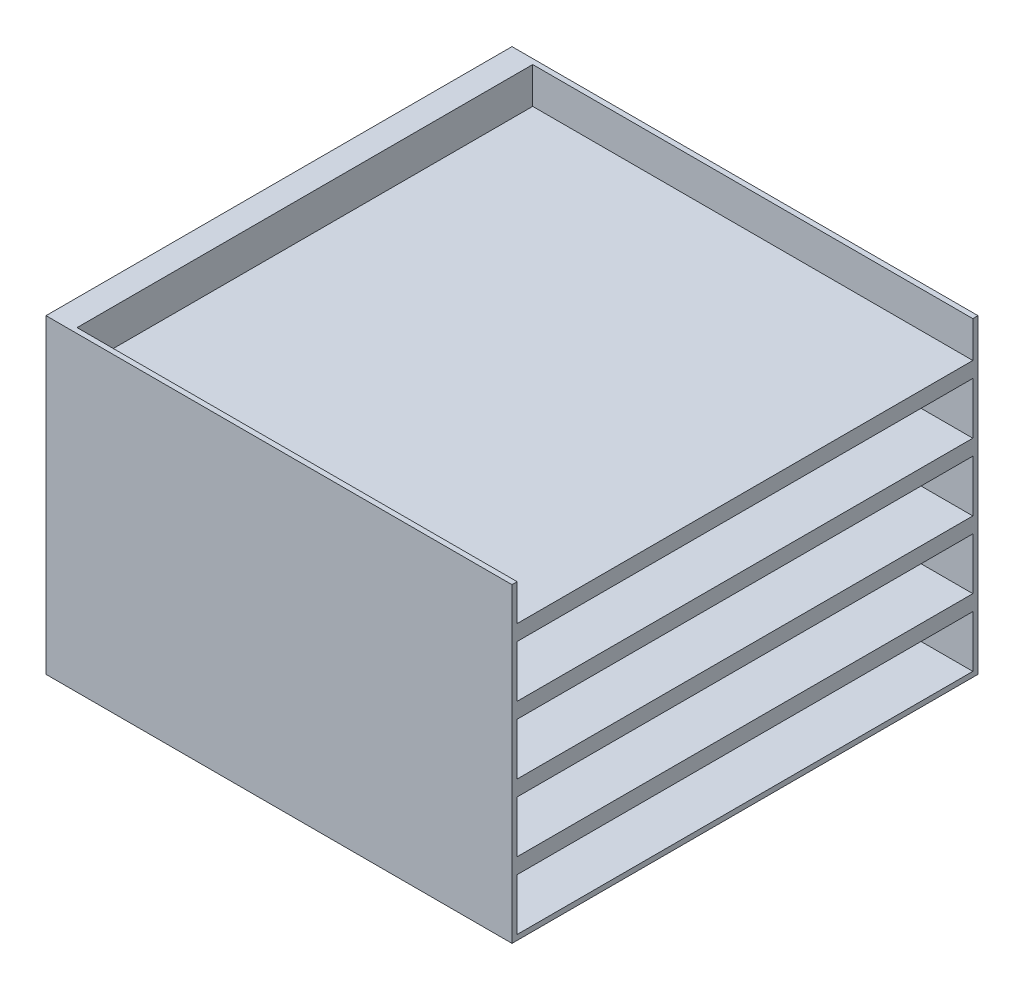
ISO-10303-21;
HEADER;
FILE_DESCRIPTION(('STEP AP214'),'2;1');
FILE_NAME('part.step','',(''),(''),'','','');
FILE_SCHEMA(('AUTOMOTIVE_DESIGN { 1 0 10303 214 1 1 1 1 }'));
ENDSEC;
DATA;
#1=APPLICATION_CONTEXT('core data for automotive mechanical design processes');
#2=APPLICATION_PROTOCOL_DEFINITION('international standard','automotive_design',2000,#1);
#3=PRODUCT_CONTEXT('',#1,'mechanical');
#4=PRODUCT('Part','Part','',(#3));
#5=PRODUCT_RELATED_PRODUCT_CATEGORY('part','',(#4));
#6=PRODUCT_DEFINITION_FORMATION('','',#4);
#7=PRODUCT_DEFINITION_CONTEXT('part definition',#1,'design');
#8=PRODUCT_DEFINITION('design','',#6,#7);
#9=PRODUCT_DEFINITION_SHAPE('','',#8);
#10=(LENGTH_UNIT() NAMED_UNIT(*) SI_UNIT(.MILLI.,.METRE.));
#11=(NAMED_UNIT(*) PLANE_ANGLE_UNIT() SI_UNIT($,.RADIAN.));
#12=(NAMED_UNIT(*) SI_UNIT($,.STERADIAN.) SOLID_ANGLE_UNIT());
#13=UNCERTAINTY_MEASURE_WITH_UNIT(LENGTH_MEASURE(1.E-05),#10,'distance_accuracy_value','');
#14=(GEOMETRIC_REPRESENTATION_CONTEXT(3) GLOBAL_UNCERTAINTY_ASSIGNED_CONTEXT((#13)) GLOBAL_UNIT_ASSIGNED_CONTEXT((#10,
#11,#12)) REPRESENTATION_CONTEXT('',''));
#15=CARTESIAN_POINT('',(0.,0.,0.));
#16=DIRECTION('',(0.,0.,1.));
#17=DIRECTION('',(1.,0.,0.));
#18=AXIS2_PLACEMENT_3D('',#15,#16,#17);
#19=CARTESIAN_POINT('',(450.,600.,-450.));
#20=DIRECTION('',(-1.,0.,0.));
#21=DIRECTION('',(0.,0.,1.));
#22=AXIS2_PLACEMENT_3D('',#19,#20,#21);
#23=PLANE('',#22);
#24=DIRECTION('',(0.,0.,-1.));
#25=VECTOR('',#24,1.);
#26=CARTESIAN_POINT('',(450.,140.,-440.));
#27=LINE('',#26,#25);
#28=CARTESIAN_POINT('',(450.,140.,440.));
#29=VERTEX_POINT('',#28);
#30=CARTESIAN_POINT('',(450.,140.,-440.));
#31=VERTEX_POINT('',#30);
#32=EDGE_CURVE('E222',#29,#31,#27,.T.);
#33=ORIENTED_EDGE('',*,*,#32,.F.);
#34=DIRECTION('',(0.,-1.,0.));
#35=VECTOR('',#34,1.);
#36=CARTESIAN_POINT('',(450.,240.,440.));
#37=LINE('',#36,#35);
#38=CARTESIAN_POINT('',(450.,240.,440.));
#39=VERTEX_POINT('',#38);
#40=EDGE_CURVE('E48',#39,#29,#37,.T.);
#41=ORIENTED_EDGE('',*,*,#40,.F.);
#42=DIRECTION('',(0.,0.,1.));
#43=VECTOR('',#42,1.);
#44=CARTESIAN_POINT('',(450.,240.,-440.));
#45=LINE('',#44,#43);
#46=CARTESIAN_POINT('',(450.,240.,-440.));
#47=VERTEX_POINT('',#46);
#48=EDGE_CURVE('E213',#47,#39,#45,.T.);
#49=ORIENTED_EDGE('',*,*,#48,.F.);
#50=DIRECTION('',(0.,1.,0.));
#51=VECTOR('',#50,1.);
#52=CARTESIAN_POINT('',(450.,240.,-440.));
#53=LINE('',#52,#51);
#54=EDGE_CURVE('E216',#31,#47,#53,.T.);
#55=ORIENTED_EDGE('',*,*,#54,.F.);
#56=EDGE_LOOP('',(#33,#41,#49,#55));
#57=FACE_BOUND('',#56,.T.);
#58=DIRECTION('',(0.,0.,-1.));
#59=VECTOR('',#58,1.);
#60=CARTESIAN_POINT('',(450.,270.,-439.999999999999));
#61=LINE('',#60,#59);
#62=CARTESIAN_POINT('',(450.,270.,440.000000000001));
#63=VERTEX_POINT('',#62);
#64=CARTESIAN_POINT('',(450.,270.,-439.999999999999));
#65=VERTEX_POINT('',#64);
#66=EDGE_CURVE('E248',#63,#65,#61,.T.);
#67=ORIENTED_EDGE('',*,*,#66,.F.);
#68=DIRECTION('',(0.,-1.,0.));
#69=VECTOR('',#68,1.);
#70=CARTESIAN_POINT('',(450.,370.,440.000000000001));
#71=LINE('',#70,#69);
#72=CARTESIAN_POINT('',(450.,370.,440.000000000001));
#73=VERTEX_POINT('',#72);
#74=EDGE_CURVE('E56',#73,#63,#71,.T.);
#75=ORIENTED_EDGE('',*,*,#74,.F.);
#76=DIRECTION('',(0.,0.,1.));
#77=VECTOR('',#76,1.);
#78=CARTESIAN_POINT('',(450.,370.,-439.999999999999));
#79=LINE('',#78,#77);
#80=CARTESIAN_POINT('',(450.,370.,-439.999999999999));
#81=VERTEX_POINT('',#80);
#82=EDGE_CURVE('E237',#81,#73,#79,.T.);
#83=ORIENTED_EDGE('',*,*,#82,.F.);
#84=DIRECTION('',(0.,1.,0.));
#85=VECTOR('',#84,1.);
#86=CARTESIAN_POINT('',(450.,370.,-439.999999999999));
#87=LINE('',#86,#85);
#88=EDGE_CURVE('E252',#65,#81,#87,.T.);
#89=ORIENTED_EDGE('',*,*,#88,.F.);
#90=EDGE_LOOP('',(#67,#75,#83,#89));
#91=FACE_BOUND('',#90,.T.);
#92=DIRECTION('',(0.,0.,-1.));
#93=VECTOR('',#92,1.);
#94=CARTESIAN_POINT('',(450.,400.,-439.999999999999));
#95=LINE('',#94,#93);
#96=CARTESIAN_POINT('',(450.,400.,440.000000000001));
#97=VERTEX_POINT('',#96);
#98=CARTESIAN_POINT('',(450.,400.,-439.999999999999));
#99=VERTEX_POINT('',#98);
#100=EDGE_CURVE('E279',#97,#99,#95,.T.);
#101=ORIENTED_EDGE('',*,*,#100,.F.);
#102=DIRECTION('',(0.,-1.,0.));
#103=VECTOR('',#102,1.);
#104=CARTESIAN_POINT('',(450.,500.,440.000000000001));
#105=LINE('',#104,#103);
#106=CARTESIAN_POINT('',(450.,500.,440.000000000001));
#107=VERTEX_POINT('',#106);
#108=EDGE_CURVE('E277',#107,#97,#105,.T.);
#109=ORIENTED_EDGE('',*,*,#108,.F.);
#110=DIRECTION('',(0.,0.,1.));
#111=VECTOR('',#110,1.);
#112=CARTESIAN_POINT('',(450.,500.,-439.999999999999));
#113=LINE('',#112,#111);
#114=CARTESIAN_POINT('',(450.,500.,-439.999999999999));
#115=VERTEX_POINT('',#114);
#116=EDGE_CURVE('E267',#115,#107,#113,.T.);
#117=ORIENTED_EDGE('',*,*,#116,.F.);
#118=DIRECTION('',(0.,1.,0.));
#119=VECTOR('',#118,1.);
#120=CARTESIAN_POINT('',(450.,500.,-439.999999999999));
#121=LINE('',#120,#119);
#122=EDGE_CURVE('E283',#99,#115,#121,.T.);
#123=ORIENTED_EDGE('',*,*,#122,.F.);
#124=EDGE_LOOP('',(#101,#109,#117,#123));
#125=FACE_BOUND('',#124,.T.);
#126=DIRECTION('',(0.,0.,-1.));
#127=VECTOR('',#126,1.);
#128=CARTESIAN_POINT('',(450.,10.,-440.));
#129=LINE('',#128,#127);
#130=CARTESIAN_POINT('',(450.,10.,440.));
#131=VERTEX_POINT('',#130);
#132=CARTESIAN_POINT('',(450.,10.,-440.));
#133=VERTEX_POINT('',#132);
#134=EDGE_CURVE('E328',#131,#133,#129,.T.);
#135=ORIENTED_EDGE('',*,*,#134,.F.);
#136=DIRECTION('',(0.,-1.,0.));
#137=VECTOR('',#136,1.);
#138=CARTESIAN_POINT('',(450.,110.,440.));
#139=LINE('',#138,#137);
#140=CARTESIAN_POINT('',(450.,110.,440.));
#141=VERTEX_POINT('',#140);
#142=EDGE_CURVE('E229',#141,#131,#139,.T.);
#143=ORIENTED_EDGE('',*,*,#142,.F.);
#144=DIRECTION('',(0.,0.,1.));
#145=VECTOR('',#144,1.);
#146=CARTESIAN_POINT('',(450.,110.,-440.));
#147=LINE('',#146,#145);
#148=CARTESIAN_POINT('',(450.,110.,-440.));
#149=VERTEX_POINT('',#148);
#150=EDGE_CURVE('E317',#149,#141,#147,.T.);
#151=ORIENTED_EDGE('',*,*,#150,.F.);
#152=DIRECTION('',(0.,1.,0.));
#153=VECTOR('',#152,1.);
#154=CARTESIAN_POINT('',(450.,110.,-440.));
#155=LINE('',#154,#153);
#156=EDGE_CURVE('E331',#133,#149,#155,.T.);
#157=ORIENTED_EDGE('',*,*,#156,.F.);
#158=EDGE_LOOP('',(#135,#143,#151,#157));
#159=FACE_BOUND('',#158,.T.);
#160=DIRECTION('',(0.,0.,-1.));
#161=VECTOR('',#160,1.);
#162=CARTESIAN_POINT('',(450.,530.,-439.999999999998));
#163=LINE('',#162,#161);
#164=CARTESIAN_POINT('',(450.,530.,440.000000000002));
#165=VERTEX_POINT('',#164);
#166=CARTESIAN_POINT('',(450.,530.,-439.999999999998));
#167=VERTEX_POINT('',#166);
#168=EDGE_CURVE('E306',#165,#167,#163,.T.);
#169=ORIENTED_EDGE('',*,*,#168,.F.);
#170=DIRECTION('',(0.,-1.,0.));
#171=VECTOR('',#170,1.);
#172=CARTESIAN_POINT('',(450.,630.,440.000000000002));
#173=LINE('',#172,#171);
#174=CARTESIAN_POINT('',(450.,600.,440.000000000002));
#175=VERTEX_POINT('',#174);
#176=EDGE_CURVE('E304',#175,#165,#173,.T.);
#177=ORIENTED_EDGE('',*,*,#176,.F.);
#178=DIRECTION('',(0.,0.,-1.));
#179=VECTOR('',#178,1.);
#180=CARTESIAN_POINT('',(450.,600.,-450.));
#181=LINE('',#180,#179);
#182=CARTESIAN_POINT('',(450.,600.,450.));
#183=VERTEX_POINT('',#182);
#184=EDGE_CURVE('E345',#183,#175,#181,.T.);
#185=ORIENTED_EDGE('',*,*,#184,.F.);
#186=DIRECTION('',(0.,-1.,0.));
#187=VECTOR('',#186,1.);
#188=CARTESIAN_POINT('',(450.,600.,450.));
#189=LINE('',#188,#187);
#190=CARTESIAN_POINT('',(450.,0.,450.));
#191=VERTEX_POINT('',#190);
#192=EDGE_CURVE('E355',#183,#191,#189,.T.);
#193=ORIENTED_EDGE('',*,*,#192,.T.);
#194=DIRECTION('',(0.,0.,-1.));
#195=VECTOR('',#194,1.);
#196=CARTESIAN_POINT('',(450.,0.,-450.));
#197=LINE('',#196,#195);
#198=CARTESIAN_POINT('',(450.,0.,-450.));
#199=VERTEX_POINT('',#198);
#200=EDGE_CURVE('E338',#191,#199,#197,.T.);
#201=ORIENTED_EDGE('',*,*,#200,.T.);
#202=DIRECTION('',(0.,-1.,0.));
#203=VECTOR('',#202,1.);
#204=CARTESIAN_POINT('',(450.,600.,-450.));
#205=LINE('',#204,#203);
#206=CARTESIAN_POINT('',(450.,600.,-450.));
#207=VERTEX_POINT('',#206);
#208=EDGE_CURVE('E372',#207,#199,#205,.T.);
#209=ORIENTED_EDGE('',*,*,#208,.F.);
#210=CARTESIAN_POINT('',(450.,600.,-439.999999999998));
#211=VERTEX_POINT('',#210);
#212=EDGE_CURVE('E349',#211,#207,#181,.T.);
#213=ORIENTED_EDGE('',*,*,#212,.F.);
#214=DIRECTION('',(0.,1.,0.));
#215=VECTOR('',#214,1.);
#216=CARTESIAN_POINT('',(450.,630.,-439.999999999998));
#217=LINE('',#216,#215);
#218=EDGE_CURVE('E298',#167,#211,#217,.T.);
#219=ORIENTED_EDGE('',*,*,#218,.F.);
#220=EDGE_LOOP('',(#169,#177,#185,#193,#201,#209,#213,#219));
#221=FACE_BOUND('',#220,.T.);
#222=ADVANCED_FACE('F34',(#57,#91,#125,#159,#221),#23,.F.);
#223=CARTESIAN_POINT('',(-450.,600.,-450.));
#224=DIRECTION('',(0.,0.,1.));
#225=DIRECTION('',(1.,0.,0.));
#226=AXIS2_PLACEMENT_3D('',#223,#224,#225);
#227=PLANE('',#226);
#228=DIRECTION('',(-1.,0.,0.));
#229=VECTOR('',#228,1.);
#230=CARTESIAN_POINT('',(-450.,0.,-450.));
#231=LINE('',#230,#229);
#232=CARTESIAN_POINT('',(-450.,0.,-450.));
#233=VERTEX_POINT('',#232);
#234=EDGE_CURVE('E358',#199,#233,#231,.T.);
#235=ORIENTED_EDGE('',*,*,#234,.T.);
#236=DIRECTION('',(0.,-1.,0.));
#237=VECTOR('',#236,1.);
#238=CARTESIAN_POINT('',(-450.,600.,-450.));
#239=LINE('',#238,#237);
#240=CARTESIAN_POINT('',(-450.,600.,-450.));
#241=VERTEX_POINT('',#240);
#242=EDGE_CURVE('E369',#241,#233,#239,.T.);
#243=ORIENTED_EDGE('',*,*,#242,.F.);
#244=DIRECTION('',(-1.,0.,0.));
#245=VECTOR('',#244,1.);
#246=CARTESIAN_POINT('',(-450.,600.,-450.));
#247=LINE('',#246,#245);
#248=EDGE_CURVE('E348',#207,#241,#247,.T.);
#249=ORIENTED_EDGE('',*,*,#248,.F.);
#250=ORIENTED_EDGE('',*,*,#208,.T.);
#251=EDGE_LOOP('',(#235,#243,#249,#250));
#252=FACE_BOUND('',#251,.T.);
#253=ADVANCED_FACE('F403',(#252),#227,.F.);
#254=CARTESIAN_POINT('',(-450.,600.,-450.));
#255=DIRECTION('',(1.,0.,0.));
#256=DIRECTION('',(0.,0.,-1.));
#257=AXIS2_PLACEMENT_3D('',#254,#255,#256);
#258=PLANE('',#257);
#259=DIRECTION('',(0.,0.,1.));
#260=VECTOR('',#259,1.);
#261=CARTESIAN_POINT('',(-450.,0.,-450.));
#262=LINE('',#261,#260);
#263=CARTESIAN_POINT('',(-450.,0.,450.));
#264=VERTEX_POINT('',#263);
#265=EDGE_CURVE('E360',#233,#264,#262,.T.);
#266=ORIENTED_EDGE('',*,*,#265,.T.);
#267=DIRECTION('',(0.,-1.,0.));
#268=VECTOR('',#267,1.);
#269=CARTESIAN_POINT('',(-450.,600.,450.));
#270=LINE('',#269,#268);
#271=CARTESIAN_POINT('',(-450.,600.,450.));
#272=VERTEX_POINT('',#271);
#273=EDGE_CURVE('E366',#272,#264,#270,.T.);
#274=ORIENTED_EDGE('',*,*,#273,.F.);
#275=DIRECTION('',(0.,0.,1.));
#276=VECTOR('',#275,1.);
#277=CARTESIAN_POINT('',(-450.,600.,-450.));
#278=LINE('',#277,#276);
#279=EDGE_CURVE('E351',#241,#272,#278,.T.);
#280=ORIENTED_EDGE('',*,*,#279,.F.);
#281=ORIENTED_EDGE('',*,*,#242,.T.);
#282=EDGE_LOOP('',(#266,#274,#280,#281));
#283=FACE_BOUND('',#282,.T.);
#284=ADVANCED_FACE('F408',(#283),#258,.F.);
#285=CARTESIAN_POINT('',(-450.,600.,450.));
#286=DIRECTION('',(0.,0.,-1.));
#287=DIRECTION('',(-1.,0.,0.));
#288=AXIS2_PLACEMENT_3D('',#285,#286,#287);
#289=PLANE('',#288);
#290=DIRECTION('',(1.,0.,0.));
#291=VECTOR('',#290,1.);
#292=CARTESIAN_POINT('',(-450.,0.,450.));
#293=LINE('',#292,#291);
#294=EDGE_CURVE('E362',#264,#191,#293,.T.);
#295=ORIENTED_EDGE('',*,*,#294,.T.);
#296=ORIENTED_EDGE('',*,*,#192,.F.);
#297=DIRECTION('',(1.,0.,0.));
#298=VECTOR('',#297,1.);
#299=CARTESIAN_POINT('',(-450.,600.,450.));
#300=LINE('',#299,#298);
#301=EDGE_CURVE('E353',#272,#183,#300,.T.);
#302=ORIENTED_EDGE('',*,*,#301,.F.);
#303=ORIENTED_EDGE('',*,*,#273,.T.);
#304=EDGE_LOOP('',(#295,#296,#302,#303));
#305=FACE_BOUND('',#304,.T.);
#306=ADVANCED_FACE('F413',(#305),#289,.F.);
#307=CARTESIAN_POINT('',(0.,600.,0.));
#308=DIRECTION('',(0.,1.,0.));
#309=DIRECTION('',(0.,0.,1.));
#310=AXIS2_PLACEMENT_3D('',#307,#308,#309);
#311=PLANE('',#310);
#312=DIRECTION('',(1.,0.,0.));
#313=VECTOR('',#312,1.);
#314=CARTESIAN_POINT('',(0.,600.,440.000000000002));
#315=LINE('',#314,#313);
#316=CARTESIAN_POINT('',(-400.,600.,440.000000000002));
#317=VERTEX_POINT('',#316);
#318=EDGE_CURVE('E11',#317,#175,#315,.T.);
#319=ORIENTED_EDGE('',*,*,#318,.F.);
#320=DIRECTION('',(0.,0.,1.));
#321=VECTOR('',#320,1.);
#322=CARTESIAN_POINT('',(-400.,600.,0.));
#323=LINE('',#322,#321);
#324=CARTESIAN_POINT('',(-400.,600.,-439.999999999998));
#325=VERTEX_POINT('',#324);
#326=EDGE_CURVE('E375',#325,#317,#323,.T.);
#327=ORIENTED_EDGE('',*,*,#326,.F.);
#328=DIRECTION('',(-1.,0.,0.));
#329=VECTOR('',#328,1.);
#330=CARTESIAN_POINT('',(0.,600.,-439.999999999998));
#331=LINE('',#330,#329);
#332=EDGE_CURVE('E41',#211,#325,#331,.T.);
#333=ORIENTED_EDGE('',*,*,#332,.F.);
#334=ORIENTED_EDGE('',*,*,#212,.T.);
#335=ORIENTED_EDGE('',*,*,#248,.T.);
#336=ORIENTED_EDGE('',*,*,#279,.T.);
#337=ORIENTED_EDGE('',*,*,#301,.T.);
#338=ORIENTED_EDGE('',*,*,#184,.T.);
#339=EDGE_LOOP('',(#319,#327,#333,#334,#335,#336,#337,#338));
#340=FACE_BOUND('',#339,.T.);
#341=ADVANCED_FACE('F386',(#340),#311,.T.);
#342=CARTESIAN_POINT('',(0.,0.,0.));
#343=DIRECTION('',(0.,1.,0.));
#344=DIRECTION('',(0.,0.,1.));
#345=AXIS2_PLACEMENT_3D('',#342,#343,#344);
#346=PLANE('',#345);
#347=ORIENTED_EDGE('',*,*,#200,.F.);
#348=ORIENTED_EDGE('',*,*,#294,.F.);
#349=ORIENTED_EDGE('',*,*,#265,.F.);
#350=ORIENTED_EDGE('',*,*,#234,.F.);
#351=EDGE_LOOP('',(#347,#348,#349,#350));
#352=FACE_BOUND('',#351,.T.);
#353=ADVANCED_FACE('F417',(#352),#346,.F.);
#354=CARTESIAN_POINT('',(-400.,110.,440.));
#355=DIRECTION('',(0.,0.,1.));
#356=DIRECTION('',(1.,0.,0.));
#357=AXIS2_PLACEMENT_3D('',#354,#355,#356);
#358=PLANE('',#357);
#359=ORIENTED_EDGE('',*,*,#142,.T.);
#360=DIRECTION('',(1.,0.,0.));
#361=VECTOR('',#360,1.);
#362=CARTESIAN_POINT('',(-400.,10.,440.));
#363=LINE('',#362,#361);
#364=CARTESIAN_POINT('',(-400.,10.,440.));
#365=VERTEX_POINT('',#364);
#366=EDGE_CURVE('E326',#365,#131,#363,.T.);
#367=ORIENTED_EDGE('',*,*,#366,.F.);
#368=DIRECTION('',(0.,-1.,0.));
#369=VECTOR('',#368,1.);
#370=CARTESIAN_POINT('',(-400.,110.,440.));
#371=LINE('',#370,#369);
#372=CARTESIAN_POINT('',(-400.,110.,440.));
#373=VERTEX_POINT('',#372);
#374=EDGE_CURVE('E313',#373,#365,#371,.T.);
#375=ORIENTED_EDGE('',*,*,#374,.F.);
#376=DIRECTION('',(1.,0.,0.));
#377=VECTOR('',#376,1.);
#378=CARTESIAN_POINT('',(-400.,110.,440.));
#379=LINE('',#378,#377);
#380=EDGE_CURVE('E336',#373,#141,#379,.T.);
#381=ORIENTED_EDGE('',*,*,#380,.T.);
#382=EDGE_LOOP('',(#359,#367,#375,#381));
#383=FACE_BOUND('',#382,.T.);
#384=ADVANCED_FACE('F419',(#383),#358,.F.);
#385=CARTESIAN_POINT('',(-400.,110.,-440.));
#386=DIRECTION('',(0.,1.,0.));
#387=DIRECTION('',(0.,0.,1.));
#388=AXIS2_PLACEMENT_3D('',#385,#386,#387);
#389=PLANE('',#388);
#390=ORIENTED_EDGE('',*,*,#150,.T.);
#391=ORIENTED_EDGE('',*,*,#380,.F.);
#392=DIRECTION('',(0.,0.,1.));
#393=VECTOR('',#392,1.);
#394=CARTESIAN_POINT('',(-400.,110.,-440.));
#395=LINE('',#394,#393);
#396=CARTESIAN_POINT('',(-400.,110.,-440.));
#397=VERTEX_POINT('',#396);
#398=EDGE_CURVE('E323',#397,#373,#395,.T.);
#399=ORIENTED_EDGE('',*,*,#398,.F.);
#400=DIRECTION('',(1.,0.,0.));
#401=VECTOR('',#400,1.);
#402=CARTESIAN_POINT('',(-400.,110.,-440.));
#403=LINE('',#402,#401);
#404=EDGE_CURVE('E339',#397,#149,#403,.T.);
#405=ORIENTED_EDGE('',*,*,#404,.T.);
#406=EDGE_LOOP('',(#390,#391,#399,#405));
#407=FACE_BOUND('',#406,.T.);
#408=ADVANCED_FACE('F425',(#407),#389,.F.);
#409=CARTESIAN_POINT('',(-400.,110.,-440.));
#410=DIRECTION('',(0.,0.,-1.));
#411=DIRECTION('',(-1.,0.,0.));
#412=AXIS2_PLACEMENT_3D('',#409,#410,#411);
#413=PLANE('',#412);
#414=ORIENTED_EDGE('',*,*,#156,.T.);
#415=ORIENTED_EDGE('',*,*,#404,.F.);
#416=DIRECTION('',(0.,1.,0.));
#417=VECTOR('',#416,1.);
#418=CARTESIAN_POINT('',(-400.,110.,-440.));
#419=LINE('',#418,#417);
#420=CARTESIAN_POINT('',(-400.,10.,-440.));
#421=VERTEX_POINT('',#420);
#422=EDGE_CURVE('E320',#421,#397,#419,.T.);
#423=ORIENTED_EDGE('',*,*,#422,.F.);
#424=DIRECTION('',(1.,0.,0.));
#425=VECTOR('',#424,1.);
#426=CARTESIAN_POINT('',(-400.,10.,-440.));
#427=LINE('',#426,#425);
#428=EDGE_CURVE('E341',#421,#133,#427,.T.);
#429=ORIENTED_EDGE('',*,*,#428,.T.);
#430=EDGE_LOOP('',(#414,#415,#423,#429));
#431=FACE_BOUND('',#430,.T.);
#432=ADVANCED_FACE('F456',(#431),#413,.F.);
#433=CARTESIAN_POINT('',(-400.,10.,-440.));
#434=DIRECTION('',(0.,-1.,0.));
#435=DIRECTION('',(0.,0.,-1.));
#436=AXIS2_PLACEMENT_3D('',#433,#434,#435);
#437=PLANE('',#436);
#438=ORIENTED_EDGE('',*,*,#134,.T.);
#439=ORIENTED_EDGE('',*,*,#428,.F.);
#440=DIRECTION('',(0.,0.,-1.));
#441=VECTOR('',#440,1.);
#442=CARTESIAN_POINT('',(-400.,10.,-440.));
#443=LINE('',#442,#441);
#444=EDGE_CURVE('E316',#365,#421,#443,.T.);
#445=ORIENTED_EDGE('',*,*,#444,.F.);
#446=ORIENTED_EDGE('',*,*,#366,.T.);
#447=EDGE_LOOP('',(#438,#439,#445,#446));
#448=FACE_BOUND('',#447,.T.);
#449=ADVANCED_FACE('F449',(#448),#437,.F.);
#450=CARTESIAN_POINT('',(-400.,0.,1.04854396770154E-13));
#451=DIRECTION('',(-1.,0.,0.));
#452=DIRECTION('',(0.,0.,1.));
#453=AXIS2_PLACEMENT_3D('',#450,#451,#452);
#454=PLANE('',#453);
#455=ORIENTED_EDGE('',*,*,#374,.T.);
#456=ORIENTED_EDGE('',*,*,#444,.T.);
#457=ORIENTED_EDGE('',*,*,#422,.T.);
#458=ORIENTED_EDGE('',*,*,#398,.T.);
#459=EDGE_LOOP('',(#455,#456,#457,#458));
#460=FACE_BOUND('',#459,.T.);
#461=ADVANCED_FACE('F458',(#460),#454,.F.);
#462=CARTESIAN_POINT('',(-400.,630.,440.000000000002));
#463=DIRECTION('',(0.,0.,1.));
#464=DIRECTION('',(1.,0.,0.));
#465=AXIS2_PLACEMENT_3D('',#462,#463,#464);
#466=PLANE('',#465);
#467=ORIENTED_EDGE('',*,*,#318,.T.);
#468=ORIENTED_EDGE('',*,*,#176,.T.);
#469=DIRECTION('',(1.,0.,0.));
#470=VECTOR('',#469,1.);
#471=CARTESIAN_POINT('',(-400.,530.,440.000000000002));
#472=LINE('',#471,#470);
#473=CARTESIAN_POINT('',(-400.,530.,440.000000000002));
#474=VERTEX_POINT('',#473);
#475=EDGE_CURVE('E303',#474,#165,#472,.T.);
#476=ORIENTED_EDGE('',*,*,#475,.F.);
#477=DIRECTION('',(0.,-1.,0.));
#478=VECTOR('',#477,1.);
#479=CARTESIAN_POINT('',(-400.,630.,440.000000000002));
#480=LINE('',#479,#478);
#481=EDGE_CURVE('E295',#317,#474,#480,.T.);
#482=ORIENTED_EDGE('',*,*,#481,.F.);
#483=EDGE_LOOP('',(#467,#468,#476,#482));
#484=FACE_BOUND('',#483,.T.);
#485=ADVANCED_FACE('F392',(#484),#466,.F.);
#486=CARTESIAN_POINT('',(-400.,630.,-439.999999999998));
#487=DIRECTION('',(0.,0.,-1.));
#488=DIRECTION('',(-1.,0.,0.));
#489=AXIS2_PLACEMENT_3D('',#486,#487,#488);
#490=PLANE('',#489);
#491=ORIENTED_EDGE('',*,*,#332,.T.);
#492=DIRECTION('',(0.,1.,0.));
#493=VECTOR('',#492,1.);
#494=CARTESIAN_POINT('',(-400.,630.,-439.999999999998));
#495=LINE('',#494,#493);
#496=CARTESIAN_POINT('',(-400.,530.,-439.999999999998));
#497=VERTEX_POINT('',#496);
#498=EDGE_CURVE('E301',#497,#325,#495,.T.);
#499=ORIENTED_EDGE('',*,*,#498,.F.);
#500=DIRECTION('',(1.,0.,0.));
#501=VECTOR('',#500,1.);
#502=CARTESIAN_POINT('',(-400.,530.,-439.999999999998));
#503=LINE('',#502,#501);
#504=EDGE_CURVE('E280',#497,#167,#503,.T.);
#505=ORIENTED_EDGE('',*,*,#504,.T.);
#506=ORIENTED_EDGE('',*,*,#218,.T.);
#507=EDGE_LOOP('',(#491,#499,#505,#506));
#508=FACE_BOUND('',#507,.T.);
#509=ADVANCED_FACE('F381',(#508),#490,.F.);
#510=CARTESIAN_POINT('',(-400.,530.,-439.999999999998));
#511=DIRECTION('',(0.,-1.,0.));
#512=DIRECTION('',(0.,0.,-1.));
#513=AXIS2_PLACEMENT_3D('',#510,#511,#512);
#514=PLANE('',#513);
#515=ORIENTED_EDGE('',*,*,#168,.T.);
#516=ORIENTED_EDGE('',*,*,#504,.F.);
#517=DIRECTION('',(0.,0.,-1.));
#518=VECTOR('',#517,1.);
#519=CARTESIAN_POINT('',(-400.,530.,-439.999999999998));
#520=LINE('',#519,#518);
#521=EDGE_CURVE('E297',#474,#497,#520,.T.);
#522=ORIENTED_EDGE('',*,*,#521,.F.);
#523=ORIENTED_EDGE('',*,*,#475,.T.);
#524=EDGE_LOOP('',(#515,#516,#522,#523));
#525=FACE_BOUND('',#524,.T.);
#526=ADVANCED_FACE('F397',(#525),#514,.F.);
#527=CARTESIAN_POINT('',(-400.,0.,1.04854396770154E-13));
#528=DIRECTION('',(-1.,0.,0.));
#529=DIRECTION('',(0.,0.,1.));
#530=AXIS2_PLACEMENT_3D('',#527,#528,#529);
#531=PLANE('',#530);
#532=ORIENTED_EDGE('',*,*,#326,.T.);
#533=ORIENTED_EDGE('',*,*,#481,.T.);
#534=ORIENTED_EDGE('',*,*,#521,.T.);
#535=ORIENTED_EDGE('',*,*,#498,.T.);
#536=EDGE_LOOP('',(#532,#533,#534,#535));
#537=FACE_BOUND('',#536,.T.);
#538=ADVANCED_FACE('F389',(#537),#531,.F.);
#539=CARTESIAN_POINT('',(-400.,500.,440.000000000001));
#540=DIRECTION('',(0.,0.,1.));
#541=DIRECTION('',(1.,0.,0.));
#542=AXIS2_PLACEMENT_3D('',#539,#540,#541);
#543=PLANE('',#542);
#544=ORIENTED_EDGE('',*,*,#108,.T.);
#545=DIRECTION('',(1.,0.,0.));
#546=VECTOR('',#545,1.);
#547=CARTESIAN_POINT('',(-400.,400.,440.000000000001));
#548=LINE('',#547,#546);
#549=CARTESIAN_POINT('',(-400.,400.,440.000000000001));
#550=VERTEX_POINT('',#549);
#551=EDGE_CURVE('E276',#550,#97,#548,.T.);
#552=ORIENTED_EDGE('',*,*,#551,.F.);
#553=DIRECTION('',(0.,-1.,0.));
#554=VECTOR('',#553,1.);
#555=CARTESIAN_POINT('',(-400.,500.,440.000000000001));
#556=LINE('',#555,#554);
#557=CARTESIAN_POINT('',(-400.,500.,440.000000000001));
#558=VERTEX_POINT('',#557);
#559=EDGE_CURVE('E263',#558,#550,#556,.T.);
#560=ORIENTED_EDGE('',*,*,#559,.F.);
#561=DIRECTION('',(1.,0.,0.));
#562=VECTOR('',#561,1.);
#563=CARTESIAN_POINT('',(-400.,500.,440.000000000001));
#564=LINE('',#563,#562);
#565=EDGE_CURVE('E249',#558,#107,#564,.T.);
#566=ORIENTED_EDGE('',*,*,#565,.T.);
#567=EDGE_LOOP('',(#544,#552,#560,#566));
#568=FACE_BOUND('',#567,.T.);
#569=ADVANCED_FACE('F514',(#568),#543,.F.);
#570=CARTESIAN_POINT('',(-400.,500.,-439.999999999999));
#571=DIRECTION('',(0.,1.,0.));
#572=DIRECTION('',(0.,0.,1.));
#573=AXIS2_PLACEMENT_3D('',#570,#571,#572);
#574=PLANE('',#573);
#575=ORIENTED_EDGE('',*,*,#116,.T.);
#576=ORIENTED_EDGE('',*,*,#565,.F.);
#577=DIRECTION('',(0.,0.,1.));
#578=VECTOR('',#577,1.);
#579=CARTESIAN_POINT('',(-400.,500.,-439.999999999999));
#580=LINE('',#579,#578);
#581=CARTESIAN_POINT('',(-400.,500.,-439.999999999999));
#582=VERTEX_POINT('',#581);
#583=EDGE_CURVE('E273',#582,#558,#580,.T.);
#584=ORIENTED_EDGE('',*,*,#583,.F.);
#585=DIRECTION('',(1.,0.,0.));
#586=VECTOR('',#585,1.);
#587=CARTESIAN_POINT('',(-400.,500.,-439.999999999999));
#588=LINE('',#587,#586);
#589=EDGE_CURVE('E289',#582,#115,#588,.T.);
#590=ORIENTED_EDGE('',*,*,#589,.T.);
#591=EDGE_LOOP('',(#575,#576,#584,#590));
#592=FACE_BOUND('',#591,.T.);
#593=ADVANCED_FACE('F523',(#592),#574,.F.);
#594=CARTESIAN_POINT('',(-400.,500.,-439.999999999999));
#595=DIRECTION('',(0.,0.,-1.));
#596=DIRECTION('',(-1.,0.,0.));
#597=AXIS2_PLACEMENT_3D('',#594,#595,#596);
#598=PLANE('',#597);
#599=ORIENTED_EDGE('',*,*,#122,.T.);
#600=ORIENTED_EDGE('',*,*,#589,.F.);
#601=DIRECTION('',(0.,1.,0.));
#602=VECTOR('',#601,1.);
#603=CARTESIAN_POINT('',(-400.,500.,-439.999999999999));
#604=LINE('',#603,#602);
#605=CARTESIAN_POINT('',(-400.,400.,-439.999999999999));
#606=VERTEX_POINT('',#605);
#607=EDGE_CURVE('E270',#606,#582,#604,.T.);
#608=ORIENTED_EDGE('',*,*,#607,.F.);
#609=DIRECTION('',(1.,0.,0.));
#610=VECTOR('',#609,1.);
#611=CARTESIAN_POINT('',(-400.,400.,-439.999999999999));
#612=LINE('',#611,#610);
#613=EDGE_CURVE('E291',#606,#99,#612,.T.);
#614=ORIENTED_EDGE('',*,*,#613,.T.);
#615=EDGE_LOOP('',(#599,#600,#608,#614));
#616=FACE_BOUND('',#615,.T.);
#617=ADVANCED_FACE('F533',(#616),#598,.F.);
#618=CARTESIAN_POINT('',(-400.,400.,-439.999999999999));
#619=DIRECTION('',(0.,-1.,0.));
#620=DIRECTION('',(0.,0.,-1.));
#621=AXIS2_PLACEMENT_3D('',#618,#619,#620);
#622=PLANE('',#621);
#623=ORIENTED_EDGE('',*,*,#100,.T.);
#624=ORIENTED_EDGE('',*,*,#613,.F.);
#625=DIRECTION('',(0.,0.,-1.));
#626=VECTOR('',#625,1.);
#627=CARTESIAN_POINT('',(-400.,400.,-439.999999999999));
#628=LINE('',#627,#626);
#629=EDGE_CURVE('E266',#550,#606,#628,.T.);
#630=ORIENTED_EDGE('',*,*,#629,.F.);
#631=ORIENTED_EDGE('',*,*,#551,.T.);
#632=EDGE_LOOP('',(#623,#624,#630,#631));
#633=FACE_BOUND('',#632,.T.);
#634=ADVANCED_FACE('F543',(#633),#622,.F.);
#635=CARTESIAN_POINT('',(-400.,0.,1.04854396770154E-13));
#636=DIRECTION('',(-1.,0.,0.));
#637=DIRECTION('',(0.,0.,1.));
#638=AXIS2_PLACEMENT_3D('',#635,#636,#637);
#639=PLANE('',#638);
#640=ORIENTED_EDGE('',*,*,#559,.T.);
#641=ORIENTED_EDGE('',*,*,#629,.T.);
#642=ORIENTED_EDGE('',*,*,#607,.T.);
#643=ORIENTED_EDGE('',*,*,#583,.T.);
#644=EDGE_LOOP('',(#640,#641,#642,#643));
#645=FACE_BOUND('',#644,.T.);
#646=ADVANCED_FACE('F553',(#645),#639,.F.);
#647=CARTESIAN_POINT('',(-400.,370.,440.000000000001));
#648=DIRECTION('',(0.,0.,1.));
#649=DIRECTION('',(1.,0.,0.));
#650=AXIS2_PLACEMENT_3D('',#647,#648,#649);
#651=PLANE('',#650);
#652=ORIENTED_EDGE('',*,*,#74,.T.);
#653=DIRECTION('',(1.,0.,0.));
#654=VECTOR('',#653,1.);
#655=CARTESIAN_POINT('',(-400.,270.,440.000000000001));
#656=LINE('',#655,#654);
#657=CARTESIAN_POINT('',(-400.,270.,440.000000000001));
#658=VERTEX_POINT('',#657);
#659=EDGE_CURVE('E246',#658,#63,#656,.T.);
#660=ORIENTED_EDGE('',*,*,#659,.F.);
#661=DIRECTION('',(0.,-1.,0.));
#662=VECTOR('',#661,1.);
#663=CARTESIAN_POINT('',(-400.,370.,440.000000000001));
#664=LINE('',#663,#662);
#665=CARTESIAN_POINT('',(-400.,370.,440.000000000001));
#666=VERTEX_POINT('',#665);
#667=EDGE_CURVE('E233',#666,#658,#664,.T.);
#668=ORIENTED_EDGE('',*,*,#667,.F.);
#669=DIRECTION('',(1.,0.,0.));
#670=VECTOR('',#669,1.);
#671=CARTESIAN_POINT('',(-400.,370.,440.000000000001));
#672=LINE('',#671,#670);
#673=EDGE_CURVE('E223',#666,#73,#672,.T.);
#674=ORIENTED_EDGE('',*,*,#673,.T.);
#675=EDGE_LOOP('',(#652,#660,#668,#674));
#676=FACE_BOUND('',#675,.T.);
#677=ADVANCED_FACE('F563',(#676),#651,.F.);
#678=CARTESIAN_POINT('',(-400.,370.,-439.999999999999));
#679=DIRECTION('',(0.,1.,0.));
#680=DIRECTION('',(0.,0.,1.));
#681=AXIS2_PLACEMENT_3D('',#678,#679,#680);
#682=PLANE('',#681);
#683=ORIENTED_EDGE('',*,*,#82,.T.);
#684=ORIENTED_EDGE('',*,*,#673,.F.);
#685=DIRECTION('',(0.,0.,1.));
#686=VECTOR('',#685,1.);
#687=CARTESIAN_POINT('',(-400.,370.,-439.999999999999));
#688=LINE('',#687,#686);
#689=CARTESIAN_POINT('',(-400.,370.,-439.999999999999));
#690=VERTEX_POINT('',#689);
#691=EDGE_CURVE('E243',#690,#666,#688,.T.);
#692=ORIENTED_EDGE('',*,*,#691,.F.);
#693=DIRECTION('',(1.,0.,0.));
#694=VECTOR('',#693,1.);
#695=CARTESIAN_POINT('',(-400.,370.,-439.999999999999));
#696=LINE('',#695,#694);
#697=EDGE_CURVE('E258',#690,#81,#696,.T.);
#698=ORIENTED_EDGE('',*,*,#697,.T.);
#699=EDGE_LOOP('',(#683,#684,#692,#698));
#700=FACE_BOUND('',#699,.T.);
#701=ADVANCED_FACE('F573',(#700),#682,.F.);
#702=CARTESIAN_POINT('',(-400.,370.,-439.999999999999));
#703=DIRECTION('',(0.,0.,-1.));
#704=DIRECTION('',(-1.,0.,0.));
#705=AXIS2_PLACEMENT_3D('',#702,#703,#704);
#706=PLANE('',#705);
#707=ORIENTED_EDGE('',*,*,#88,.T.);
#708=ORIENTED_EDGE('',*,*,#697,.F.);
#709=DIRECTION('',(0.,1.,0.));
#710=VECTOR('',#709,1.);
#711=CARTESIAN_POINT('',(-400.,370.,-439.999999999999));
#712=LINE('',#711,#710);
#713=CARTESIAN_POINT('',(-400.,270.,-439.999999999999));
#714=VERTEX_POINT('',#713);
#715=EDGE_CURVE('E240',#714,#690,#712,.T.);
#716=ORIENTED_EDGE('',*,*,#715,.F.);
#717=DIRECTION('',(1.,0.,0.));
#718=VECTOR('',#717,1.);
#719=CARTESIAN_POINT('',(-400.,270.,-439.999999999999));
#720=LINE('',#719,#718);
#721=EDGE_CURVE('E260',#714,#65,#720,.T.);
#722=ORIENTED_EDGE('',*,*,#721,.T.);
#723=EDGE_LOOP('',(#707,#708,#716,#722));
#724=FACE_BOUND('',#723,.T.);
#725=ADVANCED_FACE('F582',(#724),#706,.F.);
#726=CARTESIAN_POINT('',(-400.,270.,-439.999999999999));
#727=DIRECTION('',(0.,-1.,0.));
#728=DIRECTION('',(0.,0.,-1.));
#729=AXIS2_PLACEMENT_3D('',#726,#727,#728);
#730=PLANE('',#729);
#731=ORIENTED_EDGE('',*,*,#66,.T.);
#732=ORIENTED_EDGE('',*,*,#721,.F.);
#733=DIRECTION('',(0.,0.,-1.));
#734=VECTOR('',#733,1.);
#735=CARTESIAN_POINT('',(-400.,270.,-439.999999999999));
#736=LINE('',#735,#734);
#737=EDGE_CURVE('E236',#658,#714,#736,.T.);
#738=ORIENTED_EDGE('',*,*,#737,.F.);
#739=ORIENTED_EDGE('',*,*,#659,.T.);
#740=EDGE_LOOP('',(#731,#732,#738,#739));
#741=FACE_BOUND('',#740,.T.);
#742=ADVANCED_FACE('F592',(#741),#730,.F.);
#743=CARTESIAN_POINT('',(-400.,0.,1.04854396770154E-13));
#744=DIRECTION('',(-1.,0.,0.));
#745=DIRECTION('',(0.,0.,1.));
#746=AXIS2_PLACEMENT_3D('',#743,#744,#745);
#747=PLANE('',#746);
#748=ORIENTED_EDGE('',*,*,#667,.T.);
#749=ORIENTED_EDGE('',*,*,#737,.T.);
#750=ORIENTED_EDGE('',*,*,#715,.T.);
#751=ORIENTED_EDGE('',*,*,#691,.T.);
#752=EDGE_LOOP('',(#748,#749,#750,#751));
#753=FACE_BOUND('',#752,.T.);
#754=ADVANCED_FACE('F602',(#753),#747,.F.);
#755=CARTESIAN_POINT('',(-400.,240.,440.));
#756=DIRECTION('',(0.,0.,1.));
#757=DIRECTION('',(1.,0.,0.));
#758=AXIS2_PLACEMENT_3D('',#755,#756,#757);
#759=PLANE('',#758);
#760=ORIENTED_EDGE('',*,*,#40,.T.);
#761=DIRECTION('',(1.,0.,0.));
#762=VECTOR('',#761,1.);
#763=CARTESIAN_POINT('',(-400.,140.,440.));
#764=LINE('',#763,#762);
#765=CARTESIAN_POINT('',(-400.,140.,440.));
#766=VERTEX_POINT('',#765);
#767=EDGE_CURVE('E191',#766,#29,#764,.T.);
#768=ORIENTED_EDGE('',*,*,#767,.F.);
#769=DIRECTION('',(0.,-1.,0.));
#770=VECTOR('',#769,1.);
#771=CARTESIAN_POINT('',(-400.,240.,440.));
#772=LINE('',#771,#770);
#773=CARTESIAN_POINT('',(-400.,240.,440.));
#774=VERTEX_POINT('',#773);
#775=EDGE_CURVE('E195',#774,#766,#772,.T.);
#776=ORIENTED_EDGE('',*,*,#775,.F.);
#777=DIRECTION('',(1.,0.,0.));
#778=VECTOR('',#777,1.);
#779=CARTESIAN_POINT('',(-400.,240.,440.));
#780=LINE('',#779,#778);
#781=EDGE_CURVE('E227',#774,#39,#780,.T.);
#782=ORIENTED_EDGE('',*,*,#781,.T.);
#783=EDGE_LOOP('',(#760,#768,#776,#782));
#784=FACE_BOUND('',#783,.T.);
#785=ADVANCED_FACE('F193',(#784),#759,.F.);
#786=CARTESIAN_POINT('',(-400.,240.,-439.999999999999));
#787=DIRECTION('',(0.,1.,0.));
#788=DIRECTION('',(0.,0.,1.));
#789=AXIS2_PLACEMENT_3D('',#786,#787,#788);
#790=PLANE('',#789);
#791=ORIENTED_EDGE('',*,*,#48,.T.);
#792=ORIENTED_EDGE('',*,*,#781,.F.);
#793=DIRECTION('',(0.,0.,1.));
#794=VECTOR('',#793,1.);
#795=CARTESIAN_POINT('',(-400.,240.,-439.999999999999));
#796=LINE('',#795,#794);
#797=CARTESIAN_POINT('',(-400.,240.,-439.999999999999));
#798=VERTEX_POINT('',#797);
#799=EDGE_CURVE('E201',#798,#774,#796,.T.);
#800=ORIENTED_EDGE('',*,*,#799,.F.);
#801=DIRECTION('',(1.,0.,0.));
#802=VECTOR('',#801,1.);
#803=CARTESIAN_POINT('',(-400.,240.,-439.999999999999));
#804=LINE('',#803,#802);
#805=EDGE_CURVE('E230',#798,#47,#804,.T.);
#806=ORIENTED_EDGE('',*,*,#805,.T.);
#807=EDGE_LOOP('',(#791,#792,#800,#806));
#808=FACE_BOUND('',#807,.T.);
#809=ADVANCED_FACE('F621',(#808),#790,.F.);
#810=CARTESIAN_POINT('',(-400.,240.,-439.999999999999));
#811=DIRECTION('',(0.,0.,-1.));
#812=DIRECTION('',(-1.,0.,0.));
#813=AXIS2_PLACEMENT_3D('',#810,#811,#812);
#814=PLANE('',#813);
#815=ORIENTED_EDGE('',*,*,#54,.T.);
#816=ORIENTED_EDGE('',*,*,#805,.F.);
#817=DIRECTION('',(0.,1.,0.));
#818=VECTOR('',#817,1.);
#819=CARTESIAN_POINT('',(-400.,240.,-439.999999999999));
#820=LINE('',#819,#818);
#821=CARTESIAN_POINT('',(-400.,140.,-439.999999999999));
#822=VERTEX_POINT('',#821);
#823=EDGE_CURVE('E209',#822,#798,#820,.T.);
#824=ORIENTED_EDGE('',*,*,#823,.F.);
#825=DIRECTION('',(1.,0.,0.));
#826=VECTOR('',#825,1.);
#827=CARTESIAN_POINT('',(-400.,140.,-439.999999999999));
#828=LINE('',#827,#826);
#829=EDGE_CURVE('E200',#822,#31,#828,.T.);
#830=ORIENTED_EDGE('',*,*,#829,.T.);
#831=EDGE_LOOP('',(#815,#816,#824,#830));
#832=FACE_BOUND('',#831,.T.);
#833=ADVANCED_FACE('F630',(#832),#814,.F.);
#834=CARTESIAN_POINT('',(-400.,140.,-439.999999999999));
#835=DIRECTION('',(0.,-1.,0.));
#836=DIRECTION('',(0.,0.,-1.));
#837=AXIS2_PLACEMENT_3D('',#834,#835,#836);
#838=PLANE('',#837);
#839=ORIENTED_EDGE('',*,*,#32,.T.);
#840=ORIENTED_EDGE('',*,*,#829,.F.);
#841=DIRECTION('',(0.,0.,-1.));
#842=VECTOR('',#841,1.);
#843=CARTESIAN_POINT('',(-400.,140.,-439.999999999999));
#844=LINE('',#843,#842);
#845=EDGE_CURVE('E204',#766,#822,#844,.T.);
#846=ORIENTED_EDGE('',*,*,#845,.F.);
#847=ORIENTED_EDGE('',*,*,#767,.T.);
#848=EDGE_LOOP('',(#839,#840,#846,#847));
#849=FACE_BOUND('',#848,.T.);
#850=ADVANCED_FACE('F205',(#849),#838,.F.);
#851=CARTESIAN_POINT('',(-400.,0.,1.04854396770154E-13));
#852=DIRECTION('',(-1.,0.,0.));
#853=DIRECTION('',(0.,0.,1.));
#854=AXIS2_PLACEMENT_3D('',#851,#852,#853);
#855=PLANE('',#854);
#856=ORIENTED_EDGE('',*,*,#775,.T.);
#857=ORIENTED_EDGE('',*,*,#845,.T.);
#858=ORIENTED_EDGE('',*,*,#823,.T.);
#859=ORIENTED_EDGE('',*,*,#799,.T.);
#860=EDGE_LOOP('',(#856,#857,#858,#859));
#861=FACE_BOUND('',#860,.T.);
#862=ADVANCED_FACE('F211',(#861),#855,.F.);
#863=CLOSED_SHELL('',(#222,#253,#284,#306,#341,#353,#384,#408,#432,#449,#461,#485,#509,#526,
#538,#569,#593,#617,#634,#646,#677,#701,#725,#742,#754,#785,#809,#833,#850,#862));
#864=MANIFOLD_SOLID_BREP('B2',#863);
#865=ADVANCED_BREP_SHAPE_REPRESENTATION('',(#18,#864),#14);
#866=SHAPE_DEFINITION_REPRESENTATION(#9,#865);
ENDSEC;
END-ISO-10303-21;
